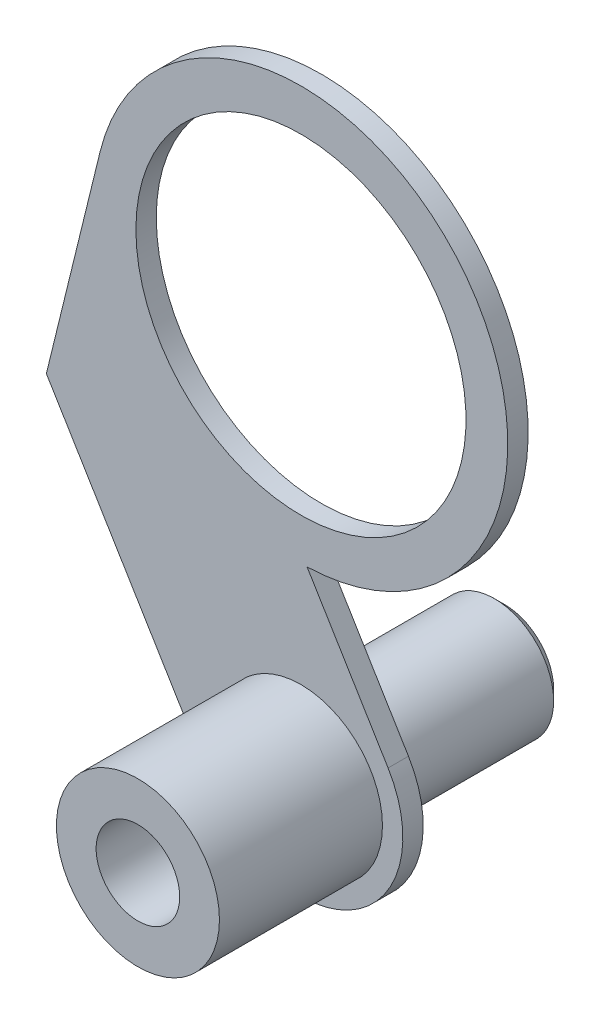
ISO-10303-21;
HEADER;
FILE_DESCRIPTION(('STEP AP214'),'2;1');
FILE_NAME('part.step','',(''),(''),'','','');
FILE_SCHEMA(('AUTOMOTIVE_DESIGN { 1 0 10303 214 1 1 1 1 }'));
ENDSEC;
DATA;
#1=APPLICATION_CONTEXT('core data for automotive mechanical design processes');
#2=APPLICATION_PROTOCOL_DEFINITION('international standard','automotive_design',2000,#1);
#3=PRODUCT_CONTEXT('',#1,'mechanical');
#4=PRODUCT('Part','Part','',(#3));
#5=PRODUCT_RELATED_PRODUCT_CATEGORY('part','',(#4));
#6=PRODUCT_DEFINITION_FORMATION('','',#4);
#7=PRODUCT_DEFINITION_CONTEXT('part definition',#1,'design');
#8=PRODUCT_DEFINITION('design','',#6,#7);
#9=PRODUCT_DEFINITION_SHAPE('','',#8);
#10=(LENGTH_UNIT() NAMED_UNIT(*) SI_UNIT(.MILLI.,.METRE.));
#11=(NAMED_UNIT(*) PLANE_ANGLE_UNIT() SI_UNIT($,.RADIAN.));
#12=(NAMED_UNIT(*) SI_UNIT($,.STERADIAN.) SOLID_ANGLE_UNIT());
#13=UNCERTAINTY_MEASURE_WITH_UNIT(LENGTH_MEASURE(1.E-05),#10,'distance_accuracy_value','');
#14=(GEOMETRIC_REPRESENTATION_CONTEXT(3) GLOBAL_UNCERTAINTY_ASSIGNED_CONTEXT((#13)) GLOBAL_UNIT_ASSIGNED_CONTEXT((#10,
#11,#12)) REPRESENTATION_CONTEXT('',''));
#15=CARTESIAN_POINT('',(0.,0.,0.));
#16=DIRECTION('',(0.,0.,1.));
#17=DIRECTION('',(1.,0.,0.));
#18=AXIS2_PLACEMENT_3D('',#15,#16,#17);
#19=CARTESIAN_POINT('',(0.,4.,-8.));
#20=DIRECTION('',(0.,0.,1.));
#21=DIRECTION('',(1.,0.,0.));
#22=AXIS2_PLACEMENT_3D('',#19,#20,#21);
#23=PLANE('',#22);
#24=CARTESIAN_POINT('',(0.,0.,-8.));
#25=DIRECTION('',(0.,0.,1.));
#26=DIRECTION('',(1.,0.,0.));
#27=AXIS2_PLACEMENT_3D('',#24,#25,#26);
#28=CIRCLE('',#27,2.9);
#29=CARTESIAN_POINT('',(2.9,0.,-8.));
#30=VERTEX_POINT('',#29);
#31=EDGE_CURVE('E11',#30,#30,#28,.T.);
#32=ORIENTED_EDGE('',*,*,#31,.T.);
#33=EDGE_LOOP('',(#32));
#34=FACE_BOUND('',#33,.T.);
#35=CARTESIAN_POINT('',(0.,0.,-8.));
#36=DIRECTION('',(0.,0.,-1.));
#37=DIRECTION('',(-1.,0.,0.));
#38=AXIS2_PLACEMENT_3D('',#35,#36,#37);
#39=CIRCLE('',#38,2.95);
#40=CARTESIAN_POINT('',(-2.95,0.,-8.));
#41=VERTEX_POINT('',#40);
#42=EDGE_CURVE('E191',#41,#41,#39,.T.);
#43=ORIENTED_EDGE('',*,*,#42,.T.);
#44=EDGE_LOOP('',(#43));
#45=FACE_BOUND('',#44,.T.);
#46=ADVANCED_FACE('F36',(#34,#45),#23,.F.);
#47=CARTESIAN_POINT('',(0.,0.,0.));
#48=DIRECTION('',(0.,0.,1.));
#49=DIRECTION('',(1.,0.,0.));
#50=AXIS2_PLACEMENT_3D('',#47,#48,#49);
#51=CYLINDRICAL_SURFACE('',#50,2.9);
#52=ORIENTED_EDGE('',*,*,#31,.F.);
#53=EDGE_LOOP('',(#52));
#54=FACE_BOUND('',#53,.T.);
#55=CARTESIAN_POINT('',(0.,0.,-17.5));
#56=DIRECTION('',(0.,0.,1.));
#57=DIRECTION('',(1.,0.,0.));
#58=AXIS2_PLACEMENT_3D('',#55,#56,#57);
#59=CIRCLE('',#58,2.9);
#60=CARTESIAN_POINT('',(2.9,0.,-17.5));
#61=VERTEX_POINT('',#60);
#62=EDGE_CURVE('E44',#61,#61,#59,.T.);
#63=ORIENTED_EDGE('',*,*,#62,.T.);
#64=EDGE_LOOP('',(#63));
#65=FACE_BOUND('',#64,.T.);
#66=ADVANCED_FACE('F145',(#54,#65),#51,.T.);
#67=CARTESIAN_POINT('',(0.,0.,-18.));
#68=DIRECTION('',(0.,0.,1.));
#69=DIRECTION('',(1.,0.,0.));
#70=AXIS2_PLACEMENT_3D('',#67,#68,#69);
#71=CONICAL_SURFACE('',#70,2.4,0.785398163397448);
#72=ORIENTED_EDGE('',*,*,#62,.F.);
#73=EDGE_LOOP('',(#72));
#74=FACE_BOUND('',#73,.T.);
#75=CARTESIAN_POINT('',(0.,0.,-18.));
#76=DIRECTION('',(0.,0.,1.));
#77=DIRECTION('',(1.,0.,0.));
#78=AXIS2_PLACEMENT_3D('',#75,#76,#77);
#79=CIRCLE('',#78,2.4);
#80=CARTESIAN_POINT('',(2.4,0.,-18.));
#81=VERTEX_POINT('',#80);
#82=EDGE_CURVE('E140',#81,#81,#79,.T.);
#83=ORIENTED_EDGE('',*,*,#82,.T.);
#84=EDGE_LOOP('',(#83));
#85=FACE_BOUND('',#84,.T.);
#86=ADVANCED_FACE('F147',(#74,#85),#71,.T.);
#87=CARTESIAN_POINT('',(0.,2.05,-18.));
#88=DIRECTION('',(0.,0.,1.));
#89=DIRECTION('',(1.,0.,0.));
#90=AXIS2_PLACEMENT_3D('',#87,#88,#89);
#91=PLANE('',#90);
#92=ORIENTED_EDGE('',*,*,#82,.F.);
#93=EDGE_LOOP('',(#92));
#94=FACE_BOUND('',#93,.T.);
#95=CARTESIAN_POINT('',(0.,0.,-18.));
#96=DIRECTION('',(0.,0.,1.));
#97=DIRECTION('',(1.,0.,0.));
#98=AXIS2_PLACEMENT_3D('',#95,#96,#97);
#99=CIRCLE('',#98,2.05);
#100=CARTESIAN_POINT('',(2.05,0.,-18.));
#101=VERTEX_POINT('',#100);
#102=EDGE_CURVE('E137',#101,#101,#99,.T.);
#103=ORIENTED_EDGE('',*,*,#102,.T.);
#104=EDGE_LOOP('',(#103));
#105=FACE_BOUND('',#104,.T.);
#106=ADVANCED_FACE('F150',(#94,#105),#91,.F.);
#107=CARTESIAN_POINT('',(0.,0.,0.));
#108=DIRECTION('',(0.,0.,1.));
#109=DIRECTION('',(1.,0.,0.));
#110=AXIS2_PLACEMENT_3D('',#107,#108,#109);
#111=CYLINDRICAL_SURFACE('',#110,2.05);
#112=ORIENTED_EDGE('',*,*,#102,.F.);
#113=EDGE_LOOP('',(#112));
#114=FACE_BOUND('',#113,.T.);
#115=CARTESIAN_POINT('',(0.,0.,0.));
#116=DIRECTION('',(0.,0.,1.));
#117=DIRECTION('',(1.,0.,0.));
#118=AXIS2_PLACEMENT_3D('',#115,#116,#117);
#119=CIRCLE('',#118,2.05);
#120=CARTESIAN_POINT('',(2.05,0.,0.));
#121=VERTEX_POINT('',#120);
#122=EDGE_CURVE('E134',#121,#121,#119,.T.);
#123=ORIENTED_EDGE('',*,*,#122,.T.);
#124=EDGE_LOOP('',(#123));
#125=FACE_BOUND('',#124,.T.);
#126=ADVANCED_FACE('F156',(#114,#125),#111,.F.);
#127=CARTESIAN_POINT('',(0.,2.05,0.));
#128=DIRECTION('',(0.,0.,-1.));
#129=DIRECTION('',(-1.,0.,0.));
#130=AXIS2_PLACEMENT_3D('',#127,#128,#129);
#131=PLANE('',#130);
#132=ORIENTED_EDGE('',*,*,#122,.F.);
#133=EDGE_LOOP('',(#132));
#134=FACE_BOUND('',#133,.T.);
#135=CARTESIAN_POINT('',(0.,0.,0.));
#136=DIRECTION('',(0.,0.,1.));
#137=DIRECTION('',(1.,0.,0.));
#138=AXIS2_PLACEMENT_3D('',#135,#136,#137);
#139=CIRCLE('',#138,4.);
#140=CARTESIAN_POINT('',(4.,0.,0.));
#141=VERTEX_POINT('',#140);
#142=EDGE_CURVE('E131',#141,#141,#139,.T.);
#143=ORIENTED_EDGE('',*,*,#142,.T.);
#144=EDGE_LOOP('',(#143));
#145=FACE_BOUND('',#144,.T.);
#146=ADVANCED_FACE('F162',(#134,#145),#131,.F.);
#147=CARTESIAN_POINT('',(0.,0.,0.));
#148=DIRECTION('',(0.,0.,1.));
#149=DIRECTION('',(1.,0.,0.));
#150=AXIS2_PLACEMENT_3D('',#147,#148,#149);
#151=CYLINDRICAL_SURFACE('',#150,4.);
#152=ORIENTED_EDGE('',*,*,#142,.F.);
#153=EDGE_LOOP('',(#152));
#154=FACE_BOUND('',#153,.T.);
#155=CARTESIAN_POINT('',(0.,0.,-8.));
#156=DIRECTION('',(0.,0.,-1.));
#157=DIRECTION('',(-1.,0.,0.));
#158=AXIS2_PLACEMENT_3D('',#155,#156,#157);
#159=CIRCLE('',#158,4.);
#160=CARTESIAN_POINT('',(-4.,0.,-8.));
#161=VERTEX_POINT('',#160);
#162=EDGE_CURVE('E128',#161,#161,#159,.T.);
#163=ORIENTED_EDGE('',*,*,#162,.F.);
#164=EDGE_LOOP('',(#163));
#165=FACE_BOUND('',#164,.T.);
#166=ADVANCED_FACE('F168',(#154,#165),#151,.T.);
#167=CARTESIAN_POINT('',(0.,19.2937813815747,-9.));
#168=DIRECTION('',(0.,0.,-1.));
#169=DIRECTION('',(-1.,0.,0.));
#170=AXIS2_PLACEMENT_3D('',#167,#168,#169);
#171=PLANE('',#170);
#172=CARTESIAN_POINT('',(0.,0.,-9.));
#173=DIRECTION('',(0.,0.,-1.));
#174=DIRECTION('',(-1.,0.,0.));
#175=AXIS2_PLACEMENT_3D('',#172,#173,#174);
#176=CIRCLE('',#175,2.95);
#177=CARTESIAN_POINT('',(-2.95,0.,-9.));
#178=VERTEX_POINT('',#177);
#179=EDGE_CURVE('E117',#178,#178,#176,.T.);
#180=ORIENTED_EDGE('',*,*,#179,.F.);
#181=EDGE_LOOP('',(#180));
#182=FACE_BOUND('',#181,.T.);
#183=CARTESIAN_POINT('',(0.,19.2937813815747,-9.));
#184=DIRECTION('',(0.,0.,-1.));
#185=DIRECTION('',(-1.,0.,0.));
#186=AXIS2_PLACEMENT_3D('',#183,#184,#185);
#187=CIRCLE('',#186,10.15);
#188=CARTESIAN_POINT('',(-9.85779006741235,21.7117298894686,-9.));
#189=VERTEX_POINT('',#188);
#190=CARTESIAN_POINT('',(0.302187827207779,9.1482807770167,-9.));
#191=VERTEX_POINT('',#190);
#192=EDGE_CURVE('E122',#189,#191,#187,.T.);
#193=ORIENTED_EDGE('',*,*,#192,.T.);
#194=DIRECTION('',(0.518301716028468,-0.855197831593337,0.));
#195=VECTOR('',#194,1.);
#196=CARTESIAN_POINT('',(4.27598915796668,2.59150858014234,-9.));
#197=LINE('',#196,#195);
#198=CARTESIAN_POINT('',(4.27598915796669,2.59150858014234,-9.));
#199=VERTEX_POINT('',#198);
#200=EDGE_CURVE('E87',#191,#199,#197,.T.);
#201=ORIENTED_EDGE('',*,*,#200,.T.);
#202=CARTESIAN_POINT('',(0.,0.,-9.));
#203=DIRECTION('',(0.,0.,-1.));
#204=DIRECTION('',(-1.,0.,0.));
#205=AXIS2_PLACEMENT_3D('',#202,#203,#204);
#206=CIRCLE('',#205,5.);
#207=CARTESIAN_POINT('',(-4.27598915796669,-2.59150858014234,-9.));
#208=VERTEX_POINT('',#207);
#209=EDGE_CURVE('E91',#199,#208,#206,.T.);
#210=ORIENTED_EDGE('',*,*,#209,.T.);
#211=DIRECTION('',(-0.518301716028468,0.855197831593337,0.));
#212=VECTOR('',#211,1.);
#213=CARTESIAN_POINT('',(-4.27598915796669,-2.59150858014234,-9.));
#214=LINE('',#213,#212);
#215=CARTESIAN_POINT('',(-12.4932832925697,10.9670267442731,-9.));
#216=VERTEX_POINT('',#215);
#217=EDGE_CURVE('E96',#208,#216,#214,.T.);
#218=ORIENTED_EDGE('',*,*,#217,.T.);
#219=DIRECTION('',(0.238221527871321,0.971210844080035,0.));
#220=VECTOR('',#219,1.);
#221=CARTESIAN_POINT('',(-9.85779006741235,21.7117298894686,-9.));
#222=LINE('',#221,#220);
#223=EDGE_CURVE('E52',#216,#189,#222,.T.);
#224=ORIENTED_EDGE('',*,*,#223,.T.);
#225=EDGE_LOOP('',(#193,#201,#210,#218,#224));
#226=FACE_BOUND('',#225,.T.);
#227=CARTESIAN_POINT('',(0.,19.2937813815747,-9.));
#228=DIRECTION('',(0.,0.,-1.));
#229=DIRECTION('',(-1.,0.,0.));
#230=AXIS2_PLACEMENT_3D('',#227,#228,#229);
#231=CIRCLE('',#230,8.09999999860031);
#232=CARTESIAN_POINT('',(-8.09999999860031,19.2937813815747,-9.));
#233=VERTEX_POINT('',#232);
#234=EDGE_CURVE('E188',#233,#233,#231,.T.);
#235=ORIENTED_EDGE('',*,*,#234,.F.);
#236=EDGE_LOOP('',(#235));
#237=FACE_BOUND('',#236,.T.);
#238=ADVANCED_FACE('F93',(#182,#226,#237),#171,.T.);
#239=CARTESIAN_POINT('',(0.,19.2937813815747,-8.));
#240=DIRECTION('',(0.,0.,-1.));
#241=DIRECTION('',(-1.,0.,0.));
#242=AXIS2_PLACEMENT_3D('',#239,#240,#241);
#243=PLANE('',#242);
#244=ORIENTED_EDGE('',*,*,#162,.T.);
#245=EDGE_LOOP('',(#244));
#246=FACE_BOUND('',#245,.T.);
#247=CARTESIAN_POINT('',(0.,19.2937813815747,-8.));
#248=DIRECTION('',(0.,0.,-1.));
#249=DIRECTION('',(-1.,0.,0.));
#250=AXIS2_PLACEMENT_3D('',#247,#248,#249);
#251=CIRCLE('',#250,10.15);
#252=CARTESIAN_POINT('',(-9.85779006741235,21.7117298894686,-8.));
#253=VERTEX_POINT('',#252);
#254=CARTESIAN_POINT('',(0.302187827207779,9.1482807770167,-8.));
#255=VERTEX_POINT('',#254);
#256=EDGE_CURVE('E113',#253,#255,#251,.T.);
#257=ORIENTED_EDGE('',*,*,#256,.F.);
#258=DIRECTION('',(0.238221527871321,0.971210844080035,0.));
#259=VECTOR('',#258,1.);
#260=CARTESIAN_POINT('',(-9.85779006741235,21.7117298894686,-8.));
#261=LINE('',#260,#259);
#262=CARTESIAN_POINT('',(-12.4932832925697,10.9670267442731,-8.));
#263=VERTEX_POINT('',#262);
#264=EDGE_CURVE('E78',#263,#253,#261,.T.);
#265=ORIENTED_EDGE('',*,*,#264,.F.);
#266=DIRECTION('',(-0.518301716028468,0.855197831593337,0.));
#267=VECTOR('',#266,1.);
#268=CARTESIAN_POINT('',(-4.27598915796669,-2.59150858014234,-8.));
#269=LINE('',#268,#267);
#270=CARTESIAN_POINT('',(-4.27598915796669,-2.59150858014234,-8.));
#271=VERTEX_POINT('',#270);
#272=EDGE_CURVE('E72',#271,#263,#269,.T.);
#273=ORIENTED_EDGE('',*,*,#272,.F.);
#274=CARTESIAN_POINT('',(0.,0.,-8.));
#275=DIRECTION('',(0.,0.,-1.));
#276=DIRECTION('',(-1.,0.,0.));
#277=AXIS2_PLACEMENT_3D('',#274,#275,#276);
#278=CIRCLE('',#277,5.);
#279=CARTESIAN_POINT('',(4.27598915796669,2.59150858014234,-8.));
#280=VERTEX_POINT('',#279);
#281=EDGE_CURVE('E103',#280,#271,#278,.T.);
#282=ORIENTED_EDGE('',*,*,#281,.F.);
#283=DIRECTION('',(0.518301716028468,-0.855197831593337,0.));
#284=VECTOR('',#283,1.);
#285=CARTESIAN_POINT('',(4.27598915796668,2.59150858014234,-8.));
#286=LINE('',#285,#284);
#287=EDGE_CURVE('E116',#255,#280,#286,.T.);
#288=ORIENTED_EDGE('',*,*,#287,.F.);
#289=EDGE_LOOP('',(#257,#265,#273,#282,#288));
#290=FACE_BOUND('',#289,.T.);
#291=CARTESIAN_POINT('',(0.,19.2937813815747,-8.));
#292=DIRECTION('',(0.,0.,-1.));
#293=DIRECTION('',(-1.,0.,0.));
#294=AXIS2_PLACEMENT_3D('',#291,#292,#293);
#295=CIRCLE('',#294,8.09999999860031);
#296=CARTESIAN_POINT('',(-8.09999999860031,19.2937813815747,-8.));
#297=VERTEX_POINT('',#296);
#298=EDGE_CURVE('E186',#297,#297,#295,.T.);
#299=ORIENTED_EDGE('',*,*,#298,.T.);
#300=EDGE_LOOP('',(#299));
#301=FACE_BOUND('',#300,.T.);
#302=ADVANCED_FACE('F177',(#246,#290,#301),#243,.F.);
#303=CARTESIAN_POINT('',(0.,19.2937813815747,-9.));
#304=DIRECTION('',(0.,0.,1.));
#305=DIRECTION('',(1.,0.,0.));
#306=AXIS2_PLACEMENT_3D('',#303,#304,#305);
#307=CYLINDRICAL_SURFACE('',#306,10.15);
#308=ORIENTED_EDGE('',*,*,#256,.T.);
#309=DIRECTION('',(0.,0.,1.));
#310=VECTOR('',#309,1.);
#311=CARTESIAN_POINT('',(0.302187827207779,9.1482807770167,-9.));
#312=LINE('',#311,#310);
#313=EDGE_CURVE('E126',#191,#255,#312,.T.);
#314=ORIENTED_EDGE('',*,*,#313,.F.);
#315=ORIENTED_EDGE('',*,*,#192,.F.);
#316=DIRECTION('',(0.,0.,1.));
#317=VECTOR('',#316,1.);
#318=CARTESIAN_POINT('',(-9.85779006741235,21.7117298894686,-9.));
#319=LINE('',#318,#317);
#320=EDGE_CURVE('E109',#189,#253,#319,.T.);
#321=ORIENTED_EDGE('',*,*,#320,.T.);
#322=EDGE_LOOP('',(#308,#314,#315,#321));
#323=FACE_BOUND('',#322,.T.);
#324=ADVANCED_FACE('F180',(#323),#307,.T.);
#325=CARTESIAN_POINT('',(4.27598915796668,2.59150858014234,-9.));
#326=DIRECTION('',(-0.855197831593337,-0.518301716028468,0.));
#327=DIRECTION('',(0.518301716028468,-0.855197831593337,0.));
#328=AXIS2_PLACEMENT_3D('',#325,#326,#327);
#329=PLANE('',#328);
#330=ORIENTED_EDGE('',*,*,#287,.T.);
#331=DIRECTION('',(0.,0.,1.));
#332=VECTOR('',#331,1.);
#333=CARTESIAN_POINT('',(4.27598915796669,2.59150858014234,-9.));
#334=LINE('',#333,#332);
#335=EDGE_CURVE('E104',#199,#280,#334,.T.);
#336=ORIENTED_EDGE('',*,*,#335,.F.);
#337=ORIENTED_EDGE('',*,*,#200,.F.);
#338=ORIENTED_EDGE('',*,*,#313,.T.);
#339=EDGE_LOOP('',(#330,#336,#337,#338));
#340=FACE_BOUND('',#339,.T.);
#341=ADVANCED_FACE('F201',(#340),#329,.F.);
#342=CARTESIAN_POINT('',(0.,0.,-9.));
#343=DIRECTION('',(0.,0.,1.));
#344=DIRECTION('',(1.,0.,0.));
#345=AXIS2_PLACEMENT_3D('',#342,#343,#344);
#346=CYLINDRICAL_SURFACE('',#345,5.);
#347=ORIENTED_EDGE('',*,*,#281,.T.);
#348=DIRECTION('',(0.,0.,1.));
#349=VECTOR('',#348,1.);
#350=CARTESIAN_POINT('',(-4.27598915796669,-2.59150858014234,-9.));
#351=LINE('',#350,#349);
#352=EDGE_CURVE('E100',#208,#271,#351,.T.);
#353=ORIENTED_EDGE('',*,*,#352,.F.);
#354=ORIENTED_EDGE('',*,*,#209,.F.);
#355=ORIENTED_EDGE('',*,*,#335,.T.);
#356=EDGE_LOOP('',(#347,#353,#354,#355));
#357=FACE_BOUND('',#356,.T.);
#358=ADVANCED_FACE('F101',(#357),#346,.T.);
#359=CARTESIAN_POINT('',(-4.27598915796669,-2.59150858014234,-9.));
#360=DIRECTION('',(0.855197831593337,0.518301716028468,0.));
#361=DIRECTION('',(-0.518301716028468,0.855197831593337,0.));
#362=AXIS2_PLACEMENT_3D('',#359,#360,#361);
#363=PLANE('',#362);
#364=ORIENTED_EDGE('',*,*,#272,.T.);
#365=DIRECTION('',(0.,0.,1.));
#366=VECTOR('',#365,1.);
#367=CARTESIAN_POINT('',(-12.4932832925697,10.9670267442731,-9.));
#368=LINE('',#367,#366);
#369=EDGE_CURVE('E105',#216,#263,#368,.T.);
#370=ORIENTED_EDGE('',*,*,#369,.F.);
#371=ORIENTED_EDGE('',*,*,#217,.F.);
#372=ORIENTED_EDGE('',*,*,#352,.T.);
#373=EDGE_LOOP('',(#364,#370,#371,#372));
#374=FACE_BOUND('',#373,.T.);
#375=ADVANCED_FACE('F107',(#374),#363,.F.);
#376=CARTESIAN_POINT('',(-9.85779006741235,21.7117298894686,-9.));
#377=DIRECTION('',(0.971210844080035,-0.238221527871321,0.));
#378=DIRECTION('',(0.238221527871321,0.971210844080035,0.));
#379=AXIS2_PLACEMENT_3D('',#376,#377,#378);
#380=PLANE('',#379);
#381=ORIENTED_EDGE('',*,*,#264,.T.);
#382=ORIENTED_EDGE('',*,*,#320,.F.);
#383=ORIENTED_EDGE('',*,*,#223,.F.);
#384=ORIENTED_EDGE('',*,*,#369,.T.);
#385=EDGE_LOOP('',(#381,#382,#383,#384));
#386=FACE_BOUND('',#385,.T.);
#387=ADVANCED_FACE('F223',(#386),#380,.F.);
#388=CARTESIAN_POINT('',(0.,0.,-9.));
#389=DIRECTION('',(0.,0.,1.));
#390=DIRECTION('',(1.,0.,0.));
#391=AXIS2_PLACEMENT_3D('',#388,#389,#390);
#392=CYLINDRICAL_SURFACE('',#391,2.95);
#393=ORIENTED_EDGE('',*,*,#179,.T.);
#394=EDGE_LOOP('',(#393));
#395=FACE_BOUND('',#394,.T.);
#396=ORIENTED_EDGE('',*,*,#42,.F.);
#397=EDGE_LOOP('',(#396));
#398=FACE_BOUND('',#397,.T.);
#399=ADVANCED_FACE('F220',(#395,#398),#392,.F.);
#400=CARTESIAN_POINT('',(0.,19.2937813815747,-9.));
#401=DIRECTION('',(0.,0.,1.));
#402=DIRECTION('',(1.,0.,0.));
#403=AXIS2_PLACEMENT_3D('',#400,#401,#402);
#404=CYLINDRICAL_SURFACE('',#403,8.09999999860031);
#405=ORIENTED_EDGE('',*,*,#234,.T.);
#406=EDGE_LOOP('',(#405));
#407=FACE_BOUND('',#406,.T.);
#408=ORIENTED_EDGE('',*,*,#298,.F.);
#409=EDGE_LOOP('',(#408));
#410=FACE_BOUND('',#409,.T.);
#411=ADVANCED_FACE('F222',(#407,#410),#404,.F.);
#412=CLOSED_SHELL('',(#46,#66,#86,#106,#126,#146,#166,#238,#302,#324,#341,#358,#375,#387,#399,#411));
#413=MANIFOLD_SOLID_BREP('B2',#412);
#414=ADVANCED_BREP_SHAPE_REPRESENTATION('',(#18,#413),#14);
#415=SHAPE_DEFINITION_REPRESENTATION(#9,#414);
ENDSEC;
END-ISO-10303-21;
